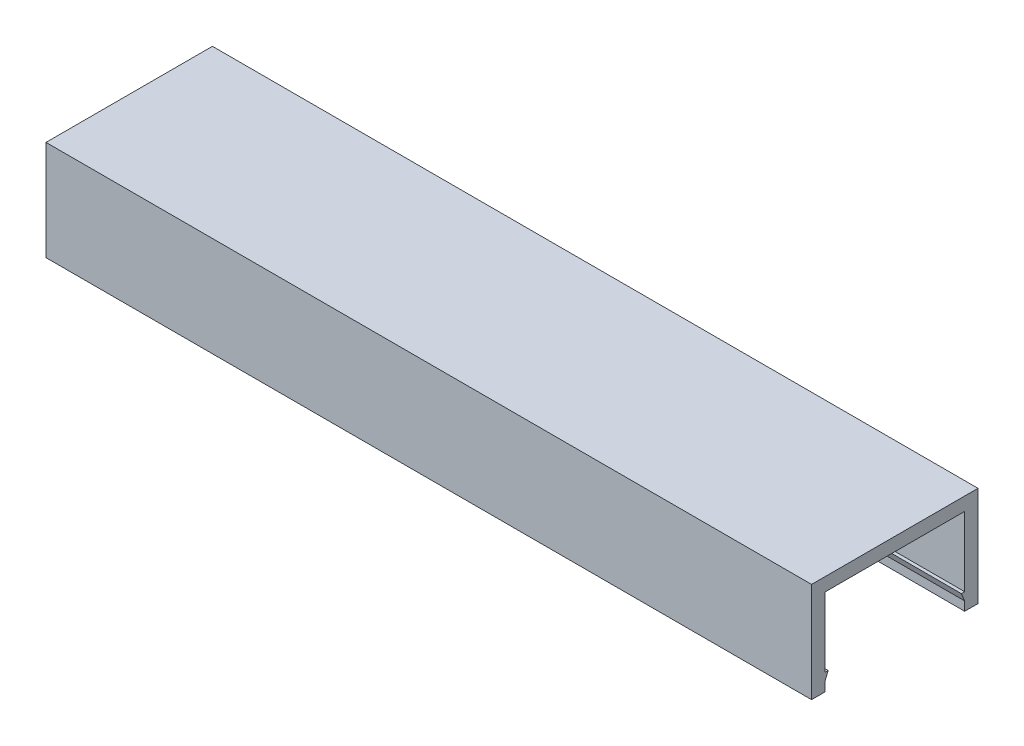
ISO-10303-21;
HEADER;
FILE_DESCRIPTION(('STEP AP214'),'2;1');
FILE_NAME('part.step','',(''),(''),'','','');
FILE_SCHEMA(('AUTOMOTIVE_DESIGN { 1 0 10303 214 1 1 1 1 }'));
ENDSEC;
DATA;
#1=APPLICATION_CONTEXT('core data for automotive mechanical design processes');
#2=APPLICATION_PROTOCOL_DEFINITION('international standard','automotive_design',2000,#1);
#3=PRODUCT_CONTEXT('',#1,'mechanical');
#4=PRODUCT('Part','Part','',(#3));
#5=PRODUCT_RELATED_PRODUCT_CATEGORY('part','',(#4));
#6=PRODUCT_DEFINITION_FORMATION('','',#4);
#7=PRODUCT_DEFINITION_CONTEXT('part definition',#1,'design');
#8=PRODUCT_DEFINITION('design','',#6,#7);
#9=PRODUCT_DEFINITION_SHAPE('','',#8);
#10=(LENGTH_UNIT() NAMED_UNIT(*) SI_UNIT(.MILLI.,.METRE.));
#11=(NAMED_UNIT(*) PLANE_ANGLE_UNIT() SI_UNIT($,.RADIAN.));
#12=(NAMED_UNIT(*) SI_UNIT($,.STERADIAN.) SOLID_ANGLE_UNIT());
#13=UNCERTAINTY_MEASURE_WITH_UNIT(LENGTH_MEASURE(1.E-05),#10,'distance_accuracy_value','');
#14=(GEOMETRIC_REPRESENTATION_CONTEXT(3) GLOBAL_UNCERTAINTY_ASSIGNED_CONTEXT((#13)) GLOBAL_UNIT_ASSIGNED_CONTEXT((#10,
#11,#12)) REPRESENTATION_CONTEXT('',''));
#15=CARTESIAN_POINT('',(0.,0.,0.));
#16=DIRECTION('',(0.,0.,1.));
#17=DIRECTION('',(1.,0.,0.));
#18=AXIS2_PLACEMENT_3D('',#15,#16,#17);
#19=CARTESIAN_POINT('',(172.5,13.,10.5));
#20=DIRECTION('',(0.,0.,1.));
#21=DIRECTION('',(1.,0.,0.));
#22=AXIS2_PLACEMENT_3D('',#19,#20,#21);
#23=PLANE('',#22);
#24=DIRECTION('',(0.,1.,0.));
#25=VECTOR('',#24,1.);
#26=CARTESIAN_POINT('',(57.5,15.,10.5));
#27=LINE('',#26,#25);
#28=CARTESIAN_POINT('',(57.5,2.55,10.5));
#29=VERTEX_POINT('',#28);
#30=CARTESIAN_POINT('',(57.5,13.,10.5));
#31=VERTEX_POINT('',#30);
#32=EDGE_CURVE('E197',#29,#31,#27,.T.);
#33=ORIENTED_EDGE('',*,*,#32,.F.);
#34=DIRECTION('',(-1.,0.,0.));
#35=VECTOR('',#34,1.);
#36=CARTESIAN_POINT('',(58.8,2.55,10.5));
#37=LINE('',#36,#35);
#38=CARTESIAN_POINT('',(-57.5,2.55,10.5));
#39=VERTEX_POINT('',#38);
#40=EDGE_CURVE('E50',#29,#39,#37,.T.);
#41=ORIENTED_EDGE('',*,*,#40,.T.);
#42=DIRECTION('',(0.,1.,0.));
#43=VECTOR('',#42,1.);
#44=CARTESIAN_POINT('',(-57.5,13.,10.5));
#45=LINE('',#44,#43);
#46=CARTESIAN_POINT('',(-57.5,13.,10.5));
#47=VERTEX_POINT('',#46);
#48=EDGE_CURVE('E156',#39,#47,#45,.T.);
#49=ORIENTED_EDGE('',*,*,#48,.T.);
#50=DIRECTION('',(-1.,0.,0.));
#51=VECTOR('',#50,1.);
#52=CARTESIAN_POINT('',(172.5,13.,10.5));
#53=LINE('',#52,#51);
#54=EDGE_CURVE('E189',#31,#47,#53,.T.);
#55=ORIENTED_EDGE('',*,*,#54,.F.);
#56=EDGE_LOOP('',(#33,#41,#49,#55));
#57=FACE_BOUND('',#56,.T.);
#58=ADVANCED_FACE('F35',(#57),#23,.F.);
#59=CARTESIAN_POINT('',(172.5,13.,-10.5));
#60=DIRECTION('',(0.,0.,-1.));
#61=DIRECTION('',(-1.,0.,0.));
#62=AXIS2_PLACEMENT_3D('',#59,#60,#61);
#63=PLANE('',#62);
#64=DIRECTION('',(0.,-1.,0.));
#65=VECTOR('',#64,1.);
#66=CARTESIAN_POINT('',(57.5,15.,-10.5));
#67=LINE('',#66,#65);
#68=CARTESIAN_POINT('',(57.5,1.35,-10.5));
#69=VERTEX_POINT('',#68);
#70=CARTESIAN_POINT('',(57.5,0.,-10.5));
#71=VERTEX_POINT('',#70);
#72=EDGE_CURVE('E192',#69,#71,#67,.T.);
#73=ORIENTED_EDGE('',*,*,#72,.F.);
#74=DIRECTION('',(-1.,0.,0.));
#75=VECTOR('',#74,1.);
#76=CARTESIAN_POINT('',(58.8,1.35,-10.5));
#77=LINE('',#76,#75);
#78=CARTESIAN_POINT('',(-57.5,1.35,-10.5));
#79=VERTEX_POINT('',#78);
#80=EDGE_CURVE('E58',#69,#79,#77,.T.);
#81=ORIENTED_EDGE('',*,*,#80,.T.);
#82=DIRECTION('',(0.,-1.,0.));
#83=VECTOR('',#82,1.);
#84=CARTESIAN_POINT('',(-57.5,13.,-10.5));
#85=LINE('',#84,#83);
#86=CARTESIAN_POINT('',(-57.5,0.,-10.5));
#87=VERTEX_POINT('',#86);
#88=EDGE_CURVE('E182',#79,#87,#85,.T.);
#89=ORIENTED_EDGE('',*,*,#88,.T.);
#90=DIRECTION('',(-1.,0.,0.));
#91=VECTOR('',#90,1.);
#92=CARTESIAN_POINT('',(0.,0.,-10.5));
#93=LINE('',#92,#91);
#94=EDGE_CURVE('E43',#71,#87,#93,.T.);
#95=ORIENTED_EDGE('',*,*,#94,.F.);
#96=EDGE_LOOP('',(#73,#81,#89,#95));
#97=FACE_BOUND('',#96,.T.);
#98=ADVANCED_FACE('F254',(#97),#63,.F.);
#99=CARTESIAN_POINT('',(0.,0.,0.));
#100=DIRECTION('',(0.,1.,0.));
#101=DIRECTION('',(0.,0.,1.));
#102=AXIS2_PLACEMENT_3D('',#99,#100,#101);
#103=PLANE('',#102);
#104=DIRECTION('',(0.,0.,-1.));
#105=VECTOR('',#104,1.);
#106=CARTESIAN_POINT('',(-57.5,0.,0.));
#107=LINE('',#106,#105);
#108=CARTESIAN_POINT('',(-57.5,0.,12.5));
#109=VERTEX_POINT('',#108);
#110=CARTESIAN_POINT('',(-57.5,0.,10.5));
#111=VERTEX_POINT('',#110);
#112=EDGE_CURVE('E224',#109,#111,#107,.T.);
#113=ORIENTED_EDGE('',*,*,#112,.T.);
#114=DIRECTION('',(1.,0.,0.));
#115=VECTOR('',#114,1.);
#116=CARTESIAN_POINT('',(0.,0.,10.5));
#117=LINE('',#116,#115);
#118=CARTESIAN_POINT('',(57.5,0.,10.5));
#119=VERTEX_POINT('',#118);
#120=EDGE_CURVE('E11',#111,#119,#117,.T.);
#121=ORIENTED_EDGE('',*,*,#120,.T.);
#122=DIRECTION('',(0.,0.,-1.));
#123=VECTOR('',#122,1.);
#124=CARTESIAN_POINT('',(57.5,0.,0.));
#125=LINE('',#124,#123);
#126=CARTESIAN_POINT('',(57.5,0.,12.5));
#127=VERTEX_POINT('',#126);
#128=EDGE_CURVE('E217',#127,#119,#125,.T.);
#129=ORIENTED_EDGE('',*,*,#128,.F.);
#130=DIRECTION('',(1.,0.,0.));
#131=VECTOR('',#130,1.);
#132=CARTESIAN_POINT('',(0.,0.,12.5));
#133=LINE('',#132,#131);
#134=EDGE_CURVE('E208',#109,#127,#133,.T.);
#135=ORIENTED_EDGE('',*,*,#134,.F.);
#136=EDGE_LOOP('',(#113,#121,#129,#135));
#137=FACE_BOUND('',#136,.T.);
#138=ADVANCED_FACE('F256',(#137),#103,.F.);
#139=CARTESIAN_POINT('',(57.5,15.,0.));
#140=DIRECTION('',(-1.,0.,0.));
#141=DIRECTION('',(0.,0.,1.));
#142=AXIS2_PLACEMENT_3D('',#139,#140,#141);
#143=PLANE('',#142);
#144=ORIENTED_EDGE('',*,*,#128,.T.);
#145=CARTESIAN_POINT('',(57.5,1.35,10.5));
#146=VERTEX_POINT('',#145);
#147=EDGE_CURVE('E198',#119,#146,#27,.T.);
#148=ORIENTED_EDGE('',*,*,#147,.T.);
#149=DIRECTION('',(0.,0.923076923076923,-0.384615384615384));
#150=VECTOR('',#149,1.);
#151=CARTESIAN_POINT('',(57.5,2.55,10.));
#152=LINE('',#151,#150);
#153=CARTESIAN_POINT('',(57.5,2.55,10.));
#154=VERTEX_POINT('',#153);
#155=EDGE_CURVE('E162',#146,#154,#152,.T.);
#156=ORIENTED_EDGE('',*,*,#155,.T.);
#157=DIRECTION('',(0.,0.,1.));
#158=VECTOR('',#157,1.);
#159=CARTESIAN_POINT('',(57.5,2.55,10.5));
#160=LINE('',#159,#158);
#161=EDGE_CURVE('E141',#154,#29,#160,.T.);
#162=ORIENTED_EDGE('',*,*,#161,.T.);
#163=ORIENTED_EDGE('',*,*,#32,.T.);
#164=DIRECTION('',(0.,0.,-1.));
#165=VECTOR('',#164,1.);
#166=CARTESIAN_POINT('',(57.5,13.,0.));
#167=LINE('',#166,#165);
#168=CARTESIAN_POINT('',(57.5,13.,-10.5));
#169=VERTEX_POINT('',#168);
#170=EDGE_CURVE('E201',#31,#169,#167,.T.);
#171=ORIENTED_EDGE('',*,*,#170,.T.);
#172=CARTESIAN_POINT('',(57.5,2.55,-10.5));
#173=VERTEX_POINT('',#172);
#174=EDGE_CURVE('E194',#169,#173,#67,.T.);
#175=ORIENTED_EDGE('',*,*,#174,.T.);
#176=DIRECTION('',(0.,0.,1.));
#177=VECTOR('',#176,1.);
#178=CARTESIAN_POINT('',(57.5,2.55,-10.5));
#179=LINE('',#178,#177);
#180=CARTESIAN_POINT('',(57.5,2.55,-10.));
#181=VERTEX_POINT('',#180);
#182=EDGE_CURVE('E167',#173,#181,#179,.T.);
#183=ORIENTED_EDGE('',*,*,#182,.T.);
#184=DIRECTION('',(0.,-0.923076923076923,-0.384615384615384));
#185=VECTOR('',#184,1.);
#186=CARTESIAN_POINT('',(57.5,2.55,-10.));
#187=LINE('',#186,#185);
#188=EDGE_CURVE('E165',#181,#69,#187,.T.);
#189=ORIENTED_EDGE('',*,*,#188,.T.);
#190=ORIENTED_EDGE('',*,*,#72,.T.);
#191=CARTESIAN_POINT('',(57.5,0.,-12.5));
#192=VERTEX_POINT('',#191);
#193=EDGE_CURVE('E204',#71,#192,#125,.T.);
#194=ORIENTED_EDGE('',*,*,#193,.T.);
#195=DIRECTION('',(0.,-1.,0.));
#196=VECTOR('',#195,1.);
#197=CARTESIAN_POINT('',(57.5,15.,-12.5));
#198=LINE('',#197,#196);
#199=CARTESIAN_POINT('',(57.5,15.,-12.5));
#200=VERTEX_POINT('',#199);
#201=EDGE_CURVE('E235',#200,#192,#198,.T.);
#202=ORIENTED_EDGE('',*,*,#201,.F.);
#203=DIRECTION('',(0.,0.,-1.));
#204=VECTOR('',#203,1.);
#205=CARTESIAN_POINT('',(57.5,15.,0.));
#206=LINE('',#205,#204);
#207=CARTESIAN_POINT('',(57.5,15.,12.5));
#208=VERTEX_POINT('',#207);
#209=EDGE_CURVE('E205',#208,#200,#206,.T.);
#210=ORIENTED_EDGE('',*,*,#209,.F.);
#211=DIRECTION('',(0.,-1.,0.));
#212=VECTOR('',#211,1.);
#213=CARTESIAN_POINT('',(57.5,15.,12.5));
#214=LINE('',#213,#212);
#215=EDGE_CURVE('E216',#208,#127,#214,.T.);
#216=ORIENTED_EDGE('',*,*,#215,.T.);
#217=EDGE_LOOP('',(#144,#148,#156,#162,#163,#171,#175,#183,#189,#190,#194,#202,#210,#216));
#218=FACE_BOUND('',#217,.T.);
#219=ADVANCED_FACE('F37',(#218),#143,.F.);
#220=CARTESIAN_POINT('',(0.,15.,-12.5));
#221=DIRECTION('',(0.,0.,-1.));
#222=DIRECTION('',(-1.,0.,0.));
#223=AXIS2_PLACEMENT_3D('',#220,#221,#222);
#224=PLANE('',#223);
#225=DIRECTION('',(1.,0.,0.));
#226=VECTOR('',#225,1.);
#227=CARTESIAN_POINT('',(0.,0.,-12.5));
#228=LINE('',#227,#226);
#229=CARTESIAN_POINT('',(-57.5,0.,-12.5));
#230=VERTEX_POINT('',#229);
#231=EDGE_CURVE('E220',#230,#192,#228,.T.);
#232=ORIENTED_EDGE('',*,*,#231,.F.);
#233=DIRECTION('',(0.,-1.,0.));
#234=VECTOR('',#233,1.);
#235=CARTESIAN_POINT('',(-57.5,15.,-12.5));
#236=LINE('',#235,#234);
#237=CARTESIAN_POINT('',(-57.5,15.,-12.5));
#238=VERTEX_POINT('',#237);
#239=EDGE_CURVE('E232',#238,#230,#236,.T.);
#240=ORIENTED_EDGE('',*,*,#239,.F.);
#241=DIRECTION('',(1.,0.,0.));
#242=VECTOR('',#241,1.);
#243=CARTESIAN_POINT('',(0.,15.,-12.5));
#244=LINE('',#243,#242);
#245=EDGE_CURVE('E207',#238,#200,#244,.T.);
#246=ORIENTED_EDGE('',*,*,#245,.T.);
#247=ORIENTED_EDGE('',*,*,#201,.T.);
#248=EDGE_LOOP('',(#232,#240,#246,#247));
#249=FACE_BOUND('',#248,.T.);
#250=ADVANCED_FACE('F250',(#249),#224,.T.);
#251=CARTESIAN_POINT('',(-57.5,15.,0.));
#252=DIRECTION('',(-1.,0.,0.));
#253=DIRECTION('',(0.,0.,1.));
#254=AXIS2_PLACEMENT_3D('',#251,#252,#253);
#255=PLANE('',#254);
#256=CARTESIAN_POINT('',(-57.5,1.35,10.5));
#257=VERTEX_POINT('',#256);
#258=EDGE_CURVE('E186',#111,#257,#45,.T.);
#259=ORIENTED_EDGE('',*,*,#258,.F.);
#260=ORIENTED_EDGE('',*,*,#112,.F.);
#261=DIRECTION('',(0.,-1.,0.));
#262=VECTOR('',#261,1.);
#263=CARTESIAN_POINT('',(-57.5,15.,12.5));
#264=LINE('',#263,#262);
#265=CARTESIAN_POINT('',(-57.5,15.,12.5));
#266=VERTEX_POINT('',#265);
#267=EDGE_CURVE('E230',#266,#109,#264,.T.);
#268=ORIENTED_EDGE('',*,*,#267,.F.);
#269=DIRECTION('',(0.,0.,-1.));
#270=VECTOR('',#269,1.);
#271=CARTESIAN_POINT('',(-57.5,15.,0.));
#272=LINE('',#271,#270);
#273=EDGE_CURVE('E211',#266,#238,#272,.T.);
#274=ORIENTED_EDGE('',*,*,#273,.T.);
#275=ORIENTED_EDGE('',*,*,#239,.T.);
#276=EDGE_CURVE('E223',#87,#230,#107,.T.);
#277=ORIENTED_EDGE('',*,*,#276,.F.);
#278=ORIENTED_EDGE('',*,*,#88,.F.);
#279=DIRECTION('',(0.,0.923076923076923,0.384615384615384));
#280=VECTOR('',#279,1.);
#281=CARTESIAN_POINT('',(-57.5,2.55,-10.));
#282=LINE('',#281,#280);
#283=CARTESIAN_POINT('',(-57.5,2.55,-10.));
#284=VERTEX_POINT('',#283);
#285=EDGE_CURVE('E164',#79,#284,#282,.T.);
#286=ORIENTED_EDGE('',*,*,#285,.T.);
#287=DIRECTION('',(0.,0.,-1.));
#288=VECTOR('',#287,1.);
#289=CARTESIAN_POINT('',(-57.5,2.55,-10.5));
#290=LINE('',#289,#288);
#291=CARTESIAN_POINT('',(-57.5,2.55,-10.5));
#292=VERTEX_POINT('',#291);
#293=EDGE_CURVE('E170',#284,#292,#290,.T.);
#294=ORIENTED_EDGE('',*,*,#293,.T.);
#295=CARTESIAN_POINT('',(-57.5,13.,-10.5));
#296=VERTEX_POINT('',#295);
#297=EDGE_CURVE('E183',#296,#292,#85,.T.);
#298=ORIENTED_EDGE('',*,*,#297,.F.);
#299=DIRECTION('',(0.,0.,-1.));
#300=VECTOR('',#299,1.);
#301=CARTESIAN_POINT('',(-57.5,13.,-10.5));
#302=LINE('',#301,#300);
#303=EDGE_CURVE('E179',#47,#296,#302,.T.);
#304=ORIENTED_EDGE('',*,*,#303,.F.);
#305=ORIENTED_EDGE('',*,*,#48,.F.);
#306=DIRECTION('',(0.,0.,-1.));
#307=VECTOR('',#306,1.);
#308=CARTESIAN_POINT('',(-57.5,2.55,10.5));
#309=LINE('',#308,#307);
#310=CARTESIAN_POINT('',(-57.5,2.55,10.));
#311=VERTEX_POINT('',#310);
#312=EDGE_CURVE('E140',#39,#311,#309,.T.);
#313=ORIENTED_EDGE('',*,*,#312,.T.);
#314=DIRECTION('',(0.,-0.923076923076923,0.384615384615384));
#315=VECTOR('',#314,1.);
#316=CARTESIAN_POINT('',(-57.5,2.55,10.));
#317=LINE('',#316,#315);
#318=EDGE_CURVE('E144',#311,#257,#317,.T.);
#319=ORIENTED_EDGE('',*,*,#318,.T.);
#320=EDGE_LOOP('',(#259,#260,#268,#274,#275,#277,#278,#286,#294,#298,#304,#305,#313,#319));
#321=FACE_BOUND('',#320,.T.);
#322=ADVANCED_FACE('F154',(#321),#255,.T.);
#323=CARTESIAN_POINT('',(0.,15.,12.5));
#324=DIRECTION('',(0.,0.,-1.));
#325=DIRECTION('',(-1.,0.,0.));
#326=AXIS2_PLACEMENT_3D('',#323,#324,#325);
#327=PLANE('',#326);
#328=ORIENTED_EDGE('',*,*,#134,.T.);
#329=ORIENTED_EDGE('',*,*,#215,.F.);
#330=DIRECTION('',(1.,0.,0.));
#331=VECTOR('',#330,1.);
#332=CARTESIAN_POINT('',(0.,15.,12.5));
#333=LINE('',#332,#331);
#334=EDGE_CURVE('E214',#266,#208,#333,.T.);
#335=ORIENTED_EDGE('',*,*,#334,.F.);
#336=ORIENTED_EDGE('',*,*,#267,.T.);
#337=EDGE_LOOP('',(#328,#329,#335,#336));
#338=FACE_BOUND('',#337,.T.);
#339=ADVANCED_FACE('F295',(#338),#327,.F.);
#340=CARTESIAN_POINT('',(0.,15.,0.));
#341=DIRECTION('',(0.,1.,0.));
#342=DIRECTION('',(0.,0.,1.));
#343=AXIS2_PLACEMENT_3D('',#340,#341,#342);
#344=PLANE('',#343);
#345=ORIENTED_EDGE('',*,*,#209,.T.);
#346=ORIENTED_EDGE('',*,*,#245,.F.);
#347=ORIENTED_EDGE('',*,*,#273,.F.);
#348=ORIENTED_EDGE('',*,*,#334,.T.);
#349=EDGE_LOOP('',(#345,#346,#347,#348));
#350=FACE_BOUND('',#349,.T.);
#351=ADVANCED_FACE('F298',(#350),#344,.T.);
#352=ORIENTED_EDGE('',*,*,#193,.F.);
#353=ORIENTED_EDGE('',*,*,#94,.T.);
#354=ORIENTED_EDGE('',*,*,#276,.T.);
#355=ORIENTED_EDGE('',*,*,#231,.T.);
#356=EDGE_LOOP('',(#352,#353,#354,#355));
#357=FACE_BOUND('',#356,.T.);
#358=ADVANCED_FACE('F242',(#357),#103,.F.);
#359=CARTESIAN_POINT('',(172.5,13.,-10.5));
#360=DIRECTION('',(0.,1.,0.));
#361=DIRECTION('',(0.,0.,1.));
#362=AXIS2_PLACEMENT_3D('',#359,#360,#361);
#363=PLANE('',#362);
#364=ORIENTED_EDGE('',*,*,#54,.T.);
#365=ORIENTED_EDGE('',*,*,#303,.T.);
#366=DIRECTION('',(-1.,0.,0.));
#367=VECTOR('',#366,1.);
#368=CARTESIAN_POINT('',(172.5,13.,-10.5));
#369=LINE('',#368,#367);
#370=EDGE_CURVE('E188',#169,#296,#369,.T.);
#371=ORIENTED_EDGE('',*,*,#370,.F.);
#372=ORIENTED_EDGE('',*,*,#170,.F.);
#373=EDGE_LOOP('',(#364,#365,#371,#372));
#374=FACE_BOUND('',#373,.T.);
#375=ADVANCED_FACE('F278',(#374),#363,.F.);
#376=ORIENTED_EDGE('',*,*,#258,.T.);
#377=DIRECTION('',(-1.,0.,0.));
#378=VECTOR('',#377,1.);
#379=CARTESIAN_POINT('',(58.8,1.35,10.5));
#380=LINE('',#379,#378);
#381=EDGE_CURVE('E143',#146,#257,#380,.T.);
#382=ORIENTED_EDGE('',*,*,#381,.F.);
#383=ORIENTED_EDGE('',*,*,#147,.F.);
#384=ORIENTED_EDGE('',*,*,#120,.F.);
#385=EDGE_LOOP('',(#376,#382,#383,#384));
#386=FACE_BOUND('',#385,.T.);
#387=ADVANCED_FACE('F267',(#386),#23,.F.);
#388=ORIENTED_EDGE('',*,*,#297,.T.);
#389=DIRECTION('',(-1.,0.,0.));
#390=VECTOR('',#389,1.);
#391=CARTESIAN_POINT('',(58.8,2.55,-10.5));
#392=LINE('',#391,#390);
#393=EDGE_CURVE('E175',#173,#292,#392,.T.);
#394=ORIENTED_EDGE('',*,*,#393,.F.);
#395=ORIENTED_EDGE('',*,*,#174,.F.);
#396=ORIENTED_EDGE('',*,*,#370,.T.);
#397=EDGE_LOOP('',(#388,#394,#395,#396));
#398=FACE_BOUND('',#397,.T.);
#399=ADVANCED_FACE('F258',(#398),#63,.F.);
#400=CARTESIAN_POINT('',(58.8,2.55,-10.));
#401=DIRECTION('',(0.,-0.384615384615384,0.923076923076923));
#402=DIRECTION('',(0.,-0.923076923076923,-0.384615384615384));
#403=AXIS2_PLACEMENT_3D('',#400,#401,#402);
#404=PLANE('',#403);
#405=ORIENTED_EDGE('',*,*,#188,.F.);
#406=DIRECTION('',(-1.,0.,0.));
#407=VECTOR('',#406,1.);
#408=CARTESIAN_POINT('',(58.8,2.55,-10.));
#409=LINE('',#408,#407);
#410=EDGE_CURVE('E173',#181,#284,#409,.T.);
#411=ORIENTED_EDGE('',*,*,#410,.T.);
#412=ORIENTED_EDGE('',*,*,#285,.F.);
#413=ORIENTED_EDGE('',*,*,#80,.F.);
#414=EDGE_LOOP('',(#405,#411,#412,#413));
#415=FACE_BOUND('',#414,.T.);
#416=ADVANCED_FACE('F270',(#415),#404,.T.);
#417=CARTESIAN_POINT('',(58.8,2.55,-10.5));
#418=DIRECTION('',(0.,1.,0.));
#419=DIRECTION('',(0.,0.,1.));
#420=AXIS2_PLACEMENT_3D('',#417,#418,#419);
#421=PLANE('',#420);
#422=ORIENTED_EDGE('',*,*,#182,.F.);
#423=ORIENTED_EDGE('',*,*,#393,.T.);
#424=ORIENTED_EDGE('',*,*,#293,.F.);
#425=ORIENTED_EDGE('',*,*,#410,.F.);
#426=EDGE_LOOP('',(#422,#423,#424,#425));
#427=FACE_BOUND('',#426,.T.);
#428=ADVANCED_FACE('F276',(#427),#421,.T.);
#429=CARTESIAN_POINT('',(58.8,2.55,10.5));
#430=DIRECTION('',(0.,1.,0.));
#431=DIRECTION('',(0.,0.,1.));
#432=AXIS2_PLACEMENT_3D('',#429,#430,#431);
#433=PLANE('',#432);
#434=ORIENTED_EDGE('',*,*,#161,.F.);
#435=DIRECTION('',(-1.,0.,0.));
#436=VECTOR('',#435,1.);
#437=CARTESIAN_POINT('',(58.8,2.55,10.));
#438=LINE('',#437,#436);
#439=EDGE_CURVE('E136',#154,#311,#438,.T.);
#440=ORIENTED_EDGE('',*,*,#439,.T.);
#441=ORIENTED_EDGE('',*,*,#312,.F.);
#442=ORIENTED_EDGE('',*,*,#40,.F.);
#443=EDGE_LOOP('',(#434,#440,#441,#442));
#444=FACE_BOUND('',#443,.T.);
#445=ADVANCED_FACE('F138',(#444),#433,.T.);
#446=CARTESIAN_POINT('',(58.8,2.55,10.));
#447=DIRECTION('',(0.,-0.384615384615384,-0.923076923076923));
#448=DIRECTION('',(0.,0.923076923076923,-0.384615384615384));
#449=AXIS2_PLACEMENT_3D('',#446,#447,#448);
#450=PLANE('',#449);
#451=ORIENTED_EDGE('',*,*,#155,.F.);
#452=ORIENTED_EDGE('',*,*,#381,.T.);
#453=ORIENTED_EDGE('',*,*,#318,.F.);
#454=ORIENTED_EDGE('',*,*,#439,.F.);
#455=EDGE_LOOP('',(#451,#452,#453,#454));
#456=FACE_BOUND('',#455,.T.);
#457=ADVANCED_FACE('F147',(#456),#450,.T.);
#458=CLOSED_SHELL('',(#58,#98,#138,#219,#250,#322,#339,#351,#358,#375,#387,#399,#416,#428,#445,#457));
#459=MANIFOLD_SOLID_BREP('B2',#458);
#460=ADVANCED_BREP_SHAPE_REPRESENTATION('',(#18,#459),#14);
#461=SHAPE_DEFINITION_REPRESENTATION(#9,#460);
ENDSEC;
END-ISO-10303-21;
